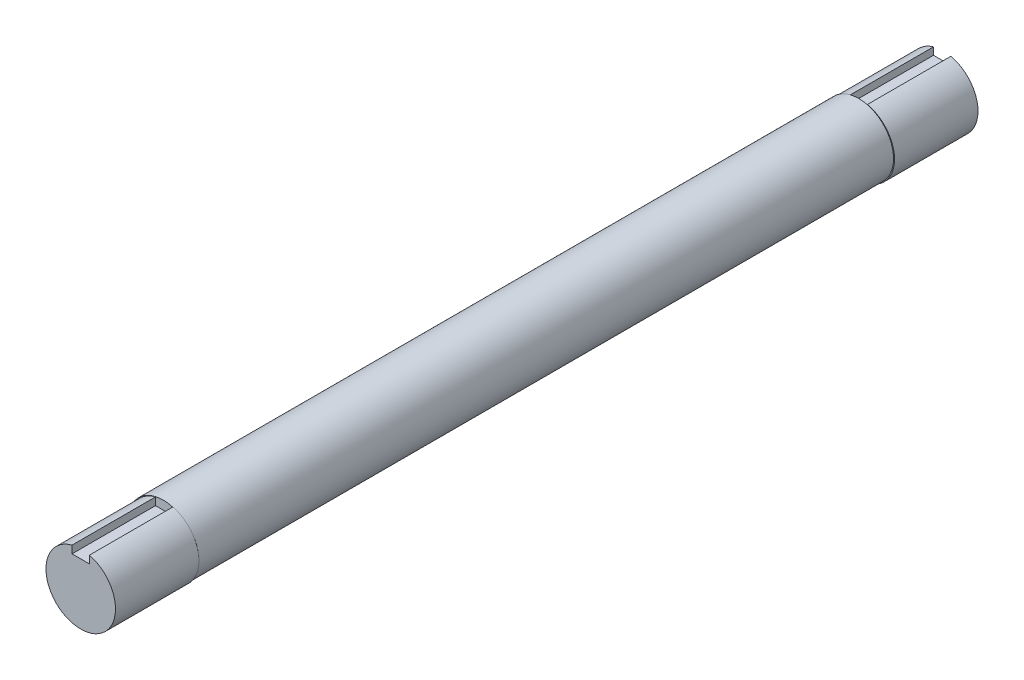
ISO-10303-21;
HEADER;
FILE_DESCRIPTION(('STEP AP214'),'2;1');
FILE_NAME('part.step','',(''),(''),'','','');
FILE_SCHEMA(('AUTOMOTIVE_DESIGN { 1 0 10303 214 1 1 1 1 }'));
ENDSEC;
DATA;
#1=APPLICATION_CONTEXT('core data for automotive mechanical design processes');
#2=APPLICATION_PROTOCOL_DEFINITION('international standard','automotive_design',2000,#1);
#3=PRODUCT_CONTEXT('',#1,'mechanical');
#4=PRODUCT('Part','Part','',(#3));
#5=PRODUCT_RELATED_PRODUCT_CATEGORY('part','',(#4));
#6=PRODUCT_DEFINITION_FORMATION('','',#4);
#7=PRODUCT_DEFINITION_CONTEXT('part definition',#1,'design');
#8=PRODUCT_DEFINITION('design','',#6,#7);
#9=PRODUCT_DEFINITION_SHAPE('','',#8);
#10=(LENGTH_UNIT() NAMED_UNIT(*) SI_UNIT(.MILLI.,.METRE.));
#11=(NAMED_UNIT(*) PLANE_ANGLE_UNIT() SI_UNIT($,.RADIAN.));
#12=(NAMED_UNIT(*) SI_UNIT($,.STERADIAN.) SOLID_ANGLE_UNIT());
#13=UNCERTAINTY_MEASURE_WITH_UNIT(LENGTH_MEASURE(1.E-05),#10,'distance_accuracy_value','');
#14=(GEOMETRIC_REPRESENTATION_CONTEXT(3) GLOBAL_UNCERTAINTY_ASSIGNED_CONTEXT((#13)) GLOBAL_UNIT_ASSIGNED_CONTEXT((#10,
#11,#12)) REPRESENTATION_CONTEXT('',''));
#15=CARTESIAN_POINT('',(0.,0.,0.));
#16=DIRECTION('',(0.,0.,1.));
#17=DIRECTION('',(1.,0.,0.));
#18=AXIS2_PLACEMENT_3D('',#15,#16,#17);
#19=CARTESIAN_POINT('',(-3.69874857792951,0.,0.));
#20=DIRECTION('',(0.,0.,1.));
#21=DIRECTION('',(1.,0.,0.));
#22=AXIS2_PLACEMENT_3D('',#19,#20,#21);
#23=PLANE('',#22);
#24=CARTESIAN_POINT('',(0.,0.,0.));
#25=DIRECTION('',(0.,0.,-1.));
#26=DIRECTION('',(-1.,0.,0.));
#27=AXIS2_PLACEMENT_3D('',#24,#25,#26);
#28=CIRCLE('',#27,127.053849768682);
#29=CARTESIAN_POINT('',(-3.69874857792983,-127.,0.));
#30=VERTEX_POINT('',#29);
#31=CARTESIAN_POINT('',(-35.4487485779296,122.008470875187,0.));
#32=VERTEX_POINT('',#31);
#33=EDGE_CURVE('E11',#30,#32,#28,.T.);
#34=ORIENTED_EDGE('',*,*,#33,.F.);
#35=CARTESIAN_POINT('',(-3.69874857792951,0.,0.));
#36=DIRECTION('',(0.,0.,1.));
#37=DIRECTION('',(1.,0.,0.));
#38=AXIS2_PLACEMENT_3D('',#35,#36,#37);
#39=CIRCLE('',#38,127.);
#40=CARTESIAN_POINT('',(28.0512514220705,122.967221242085,0.));
#41=VERTEX_POINT('',#40);
#42=EDGE_CURVE('E42',#41,#30,#39,.T.);
#43=ORIENTED_EDGE('',*,*,#42,.F.);
#44=DIRECTION('',(0.,1.,0.));
#45=VECTOR('',#44,1.);
#46=CARTESIAN_POINT('',(28.0512514220705,123.918554037313,0.));
#47=LINE('',#46,#45);
#48=CARTESIAN_POINT('',(28.0512514220705,95.25,0.));
#49=VERTEX_POINT('',#48);
#50=EDGE_CURVE('E194',#49,#41,#47,.T.);
#51=ORIENTED_EDGE('',*,*,#50,.F.);
#52=DIRECTION('',(1.,0.,0.));
#53=VECTOR('',#52,1.);
#54=CARTESIAN_POINT('',(28.0512514220705,95.25,0.));
#55=LINE('',#54,#53);
#56=CARTESIAN_POINT('',(-35.4487485779295,95.25,0.));
#57=VERTEX_POINT('',#56);
#58=EDGE_CURVE('E60',#57,#49,#55,.T.);
#59=ORIENTED_EDGE('',*,*,#58,.F.);
#60=DIRECTION('',(0.,-1.,0.));
#61=VECTOR('',#60,1.);
#62=CARTESIAN_POINT('',(-35.4487485779295,122.008470875187,0.));
#63=LINE('',#62,#61);
#64=EDGE_CURVE('E56',#32,#57,#63,.T.);
#65=ORIENTED_EDGE('',*,*,#64,.F.);
#66=EDGE_LOOP('',(#34,#43,#51,#59,#65));
#67=FACE_BOUND('',#66,.T.);
#68=ADVANCED_FACE('F38',(#67),#23,.F.);
#69=CARTESIAN_POINT('',(-3.69874857792951,0.,2540.));
#70=DIRECTION('',(0.,0.,-1.));
#71=DIRECTION('',(-1.,0.,0.));
#72=AXIS2_PLACEMENT_3D('',#69,#70,#71);
#73=CYLINDRICAL_SURFACE('',#72,127.);
#74=CARTESIAN_POINT('',(-3.69874857792951,0.,2540.));
#75=DIRECTION('',(0.,0.,1.));
#76=DIRECTION('',(1.,0.,0.));
#77=AXIS2_PLACEMENT_3D('',#74,#75,#76);
#78=CIRCLE('',#77,127.);
#79=CARTESIAN_POINT('',(31.75,121.95239326991,2540.));
#80=VERTEX_POINT('',#79);
#81=CARTESIAN_POINT('',(3.28730098697605E-13,-126.946127388579,2540.));
#82=VERTEX_POINT('',#81);
#83=EDGE_CURVE('E175',#80,#82,#78,.T.);
#84=ORIENTED_EDGE('',*,*,#83,.F.);
#85=EDGE_CURVE('E177',#82,#80,#78,.T.);
#86=ORIENTED_EDGE('',*,*,#85,.F.);
#87=EDGE_LOOP('',(#84,#86));
#88=FACE_BOUND('',#87,.T.);
#89=ORIENTED_EDGE('',*,*,#42,.T.);
#90=EDGE_CURVE('E174',#30,#41,#39,.T.);
#91=ORIENTED_EDGE('',*,*,#90,.T.);
#92=EDGE_LOOP('',(#89,#91));
#93=FACE_BOUND('',#92,.T.);
#94=ADVANCED_FACE('F40',(#88,#93),#73,.T.);
#95=CARTESIAN_POINT('',(-3.69874857792951,0.,2540.));
#96=DIRECTION('',(0.,0.,1.));
#97=DIRECTION('',(1.,0.,0.));
#98=AXIS2_PLACEMENT_3D('',#95,#96,#97);
#99=PLANE('',#98);
#100=DIRECTION('',(0.,-1.,0.));
#101=VECTOR('',#100,1.);
#102=CARTESIAN_POINT('',(31.75,122.911581061173,2540.));
#103=LINE('',#102,#101);
#104=CARTESIAN_POINT('',(31.75,95.1961273885787,2540.));
#105=VERTEX_POINT('',#104);
#106=EDGE_CURVE('E47',#80,#105,#103,.T.);
#107=ORIENTED_EDGE('',*,*,#106,.F.);
#108=ORIENTED_EDGE('',*,*,#83,.T.);
#109=CARTESIAN_POINT('',(0.,0.,2540.));
#110=DIRECTION('',(0.,0.,1.));
#111=DIRECTION('',(1.,0.,0.));
#112=AXIS2_PLACEMENT_3D('',#109,#110,#111);
#113=CIRCLE('',#112,126.946127388579);
#114=CARTESIAN_POINT('',(-31.75,122.911581061173,2540.));
#115=VERTEX_POINT('',#114);
#116=EDGE_CURVE('E149',#115,#82,#113,.T.);
#117=ORIENTED_EDGE('',*,*,#116,.F.);
#118=DIRECTION('',(0.,1.,0.));
#119=VECTOR('',#118,1.);
#120=CARTESIAN_POINT('',(-31.75,122.911581061173,2540.));
#121=LINE('',#120,#119);
#122=CARTESIAN_POINT('',(-31.75,95.1961273885787,2540.));
#123=VERTEX_POINT('',#122);
#124=EDGE_CURVE('E158',#123,#115,#121,.T.);
#125=ORIENTED_EDGE('',*,*,#124,.F.);
#126=DIRECTION('',(-1.,0.,0.));
#127=VECTOR('',#126,1.);
#128=CARTESIAN_POINT('',(-31.75,95.1961273885787,2540.));
#129=LINE('',#128,#127);
#130=EDGE_CURVE('E139',#105,#123,#129,.T.);
#131=ORIENTED_EDGE('',*,*,#130,.F.);
#132=EDGE_LOOP('',(#107,#108,#117,#125,#131));
#133=FACE_BOUND('',#132,.T.);
#134=ADVANCED_FACE('F223',(#133),#99,.T.);
#135=CARTESIAN_POINT('',(0.,0.,2540.));
#136=DIRECTION('',(0.,0.,1.));
#137=DIRECTION('',(1.,0.,0.));
#138=AXIS2_PLACEMENT_3D('',#135,#136,#137);
#139=PLANE('',#138);
#140=CARTESIAN_POINT('',(31.75,122.911581061173,2540.));
#141=VERTEX_POINT('',#140);
#142=EDGE_CURVE('E161',#82,#141,#113,.T.);
#143=ORIENTED_EDGE('',*,*,#142,.F.);
#144=ORIENTED_EDGE('',*,*,#85,.T.);
#145=EDGE_CURVE('E136',#141,#80,#103,.T.);
#146=ORIENTED_EDGE('',*,*,#145,.F.);
#147=EDGE_LOOP('',(#143,#144,#146));
#148=FACE_BOUND('',#147,.T.);
#149=ADVANCED_FACE('F228',(#148),#139,.F.);
#150=CARTESIAN_POINT('',(31.75,122.911581061173,2844.8));
#151=DIRECTION('',(1.,0.,0.));
#152=DIRECTION('',(0.,1.,0.));
#153=AXIS2_PLACEMENT_3D('',#150,#151,#152);
#154=PLANE('',#153);
#155=ORIENTED_EDGE('',*,*,#145,.T.);
#156=ORIENTED_EDGE('',*,*,#106,.T.);
#157=DIRECTION('',(0.,0.,-1.));
#158=VECTOR('',#157,1.);
#159=CARTESIAN_POINT('',(31.75,95.1961273885787,2844.8));
#160=LINE('',#159,#158);
#161=CARTESIAN_POINT('',(31.75,95.1961273885787,2844.8));
#162=VERTEX_POINT('',#161);
#163=EDGE_CURVE('E172',#162,#105,#160,.T.);
#164=ORIENTED_EDGE('',*,*,#163,.F.);
#165=DIRECTION('',(0.,-1.,0.));
#166=VECTOR('',#165,1.);
#167=CARTESIAN_POINT('',(31.75,122.911581061173,2844.8));
#168=LINE('',#167,#166);
#169=CARTESIAN_POINT('',(31.75,122.911581061173,2844.8));
#170=VERTEX_POINT('',#169);
#171=EDGE_CURVE('E145',#170,#162,#168,.T.);
#172=ORIENTED_EDGE('',*,*,#171,.F.);
#173=DIRECTION('',(0.,0.,-1.));
#174=VECTOR('',#173,1.);
#175=CARTESIAN_POINT('',(31.75,122.911581061173,2844.8));
#176=LINE('',#175,#174);
#177=EDGE_CURVE('E154',#170,#141,#176,.T.);
#178=ORIENTED_EDGE('',*,*,#177,.T.);
#179=EDGE_LOOP('',(#155,#156,#164,#172,#178));
#180=FACE_BOUND('',#179,.T.);
#181=ADVANCED_FACE('F229',(#180),#154,.F.);
#182=CARTESIAN_POINT('',(-31.75,95.1961273885787,2844.8));
#183=DIRECTION('',(0.,-1.,0.));
#184=DIRECTION('',(0.,0.,-1.));
#185=AXIS2_PLACEMENT_3D('',#182,#183,#184);
#186=PLANE('',#185);
#187=ORIENTED_EDGE('',*,*,#130,.T.);
#188=DIRECTION('',(0.,0.,-1.));
#189=VECTOR('',#188,1.);
#190=CARTESIAN_POINT('',(-31.75,95.1961273885787,2844.8));
#191=LINE('',#190,#189);
#192=CARTESIAN_POINT('',(-31.75,95.1961273885787,2844.8));
#193=VERTEX_POINT('',#192);
#194=EDGE_CURVE('E169',#193,#123,#191,.T.);
#195=ORIENTED_EDGE('',*,*,#194,.F.);
#196=DIRECTION('',(-1.,0.,0.));
#197=VECTOR('',#196,1.);
#198=CARTESIAN_POINT('',(-31.75,95.1961273885787,2844.8));
#199=LINE('',#198,#197);
#200=EDGE_CURVE('E148',#162,#193,#199,.T.);
#201=ORIENTED_EDGE('',*,*,#200,.F.);
#202=ORIENTED_EDGE('',*,*,#163,.T.);
#203=EDGE_LOOP('',(#187,#195,#201,#202));
#204=FACE_BOUND('',#203,.T.);
#205=ADVANCED_FACE('F232',(#204),#186,.F.);
#206=CARTESIAN_POINT('',(-31.75,122.911581061173,2844.8));
#207=DIRECTION('',(-1.,0.,0.));
#208=DIRECTION('',(0.,-1.,0.));
#209=AXIS2_PLACEMENT_3D('',#206,#207,#208);
#210=PLANE('',#209);
#211=ORIENTED_EDGE('',*,*,#124,.T.);
#212=DIRECTION('',(0.,0.,-1.));
#213=VECTOR('',#212,1.);
#214=CARTESIAN_POINT('',(-31.75,122.911581061173,2844.8));
#215=LINE('',#214,#213);
#216=CARTESIAN_POINT('',(-31.75,122.911581061173,2844.8));
#217=VERTEX_POINT('',#216);
#218=EDGE_CURVE('E166',#217,#115,#215,.T.);
#219=ORIENTED_EDGE('',*,*,#218,.F.);
#220=DIRECTION('',(0.,1.,0.));
#221=VECTOR('',#220,1.);
#222=CARTESIAN_POINT('',(-31.75,122.911581061173,2844.8));
#223=LINE('',#222,#221);
#224=EDGE_CURVE('E151',#193,#217,#223,.T.);
#225=ORIENTED_EDGE('',*,*,#224,.F.);
#226=ORIENTED_EDGE('',*,*,#194,.T.);
#227=EDGE_LOOP('',(#211,#219,#225,#226));
#228=FACE_BOUND('',#227,.T.);
#229=ADVANCED_FACE('F236',(#228),#210,.F.);
#230=CARTESIAN_POINT('',(0.,0.,2844.8));
#231=DIRECTION('',(0.,0.,-1.));
#232=DIRECTION('',(-1.,0.,0.));
#233=AXIS2_PLACEMENT_3D('',#230,#231,#232);
#234=CYLINDRICAL_SURFACE('',#233,126.946127388579);
#235=ORIENTED_EDGE('',*,*,#116,.T.);
#236=ORIENTED_EDGE('',*,*,#142,.T.);
#237=ORIENTED_EDGE('',*,*,#177,.F.);
#238=CARTESIAN_POINT('',(0.,0.,2844.8));
#239=DIRECTION('',(0.,0.,1.));
#240=DIRECTION('',(1.,0.,0.));
#241=AXIS2_PLACEMENT_3D('',#238,#239,#240);
#242=CIRCLE('',#241,126.946127388579);
#243=EDGE_CURVE('E153',#217,#170,#242,.T.);
#244=ORIENTED_EDGE('',*,*,#243,.F.);
#245=ORIENTED_EDGE('',*,*,#218,.T.);
#246=EDGE_LOOP('',(#235,#236,#237,#244,#245));
#247=FACE_BOUND('',#246,.T.);
#248=ADVANCED_FACE('F240',(#247),#234,.T.);
#249=CARTESIAN_POINT('',(0.,0.,2844.8));
#250=DIRECTION('',(0.,0.,1.));
#251=DIRECTION('',(1.,0.,0.));
#252=AXIS2_PLACEMENT_3D('',#249,#250,#251);
#253=PLANE('',#252);
#254=ORIENTED_EDGE('',*,*,#171,.T.);
#255=ORIENTED_EDGE('',*,*,#200,.T.);
#256=ORIENTED_EDGE('',*,*,#224,.T.);
#257=ORIENTED_EDGE('',*,*,#243,.T.);
#258=EDGE_LOOP('',(#254,#255,#256,#257));
#259=FACE_BOUND('',#258,.T.);
#260=ADVANCED_FACE('F244',(#259),#253,.T.);
#261=CARTESIAN_POINT('',(-35.4487485779295,122.008470875187,-304.8));
#262=DIRECTION('',(-1.,0.,0.));
#263=DIRECTION('',(0.,0.,1.));
#264=AXIS2_PLACEMENT_3D('',#261,#262,#263);
#265=PLANE('',#264);
#266=ORIENTED_EDGE('',*,*,#64,.T.);
#267=DIRECTION('',(0.,0.,1.));
#268=VECTOR('',#267,1.);
#269=CARTESIAN_POINT('',(-35.4487485779295,95.25,-304.8));
#270=LINE('',#269,#268);
#271=CARTESIAN_POINT('',(-35.4487485779295,95.25,-304.8));
#272=VERTEX_POINT('',#271);
#273=EDGE_CURVE('E119',#272,#57,#270,.T.);
#274=ORIENTED_EDGE('',*,*,#273,.F.);
#275=DIRECTION('',(0.,-1.,0.));
#276=VECTOR('',#275,1.);
#277=CARTESIAN_POINT('',(-35.4487485779295,122.008470875187,-304.8));
#278=LINE('',#277,#276);
#279=CARTESIAN_POINT('',(-35.4487485779296,122.008470875187,-304.8));
#280=VERTEX_POINT('',#279);
#281=EDGE_CURVE('E125',#280,#272,#278,.T.);
#282=ORIENTED_EDGE('',*,*,#281,.F.);
#283=DIRECTION('',(0.,0.,1.));
#284=VECTOR('',#283,1.);
#285=CARTESIAN_POINT('',(-35.4487485779296,122.008470875187,-304.8));
#286=LINE('',#285,#284);
#287=EDGE_CURVE('E205',#280,#32,#286,.T.);
#288=ORIENTED_EDGE('',*,*,#287,.T.);
#289=EDGE_LOOP('',(#266,#274,#282,#288));
#290=FACE_BOUND('',#289,.T.);
#291=ADVANCED_FACE('F135',(#290),#265,.F.);
#292=CARTESIAN_POINT('',(28.0512514220705,95.25,-304.8));
#293=DIRECTION('',(0.,-1.,0.));
#294=DIRECTION('',(0.,0.,-1.));
#295=AXIS2_PLACEMENT_3D('',#292,#293,#294);
#296=PLANE('',#295);
#297=ORIENTED_EDGE('',*,*,#58,.T.);
#298=DIRECTION('',(0.,0.,1.));
#299=VECTOR('',#298,1.);
#300=CARTESIAN_POINT('',(28.0512514220705,95.25,-304.8));
#301=LINE('',#300,#299);
#302=CARTESIAN_POINT('',(28.0512514220705,95.25,-304.8));
#303=VERTEX_POINT('',#302);
#304=EDGE_CURVE('E121',#303,#49,#301,.T.);
#305=ORIENTED_EDGE('',*,*,#304,.F.);
#306=DIRECTION('',(1.,0.,0.));
#307=VECTOR('',#306,1.);
#308=CARTESIAN_POINT('',(28.0512514220705,95.25,-304.8));
#309=LINE('',#308,#307);
#310=EDGE_CURVE('E115',#272,#303,#309,.T.);
#311=ORIENTED_EDGE('',*,*,#310,.F.);
#312=ORIENTED_EDGE('',*,*,#273,.T.);
#313=EDGE_LOOP('',(#297,#305,#311,#312));
#314=FACE_BOUND('',#313,.T.);
#315=ADVANCED_FACE('F117',(#314),#296,.F.);
#316=CARTESIAN_POINT('',(28.0512514220705,123.918554037313,-304.8));
#317=DIRECTION('',(1.,0.,0.));
#318=DIRECTION('',(0.,0.,-1.));
#319=AXIS2_PLACEMENT_3D('',#316,#317,#318);
#320=PLANE('',#319);
#321=ORIENTED_EDGE('',*,*,#50,.T.);
#322=CARTESIAN_POINT('',(28.0512514220705,123.918554037313,0.));
#323=VERTEX_POINT('',#322);
#324=EDGE_CURVE('E195',#41,#323,#47,.T.);
#325=ORIENTED_EDGE('',*,*,#324,.T.);
#326=DIRECTION('',(0.,0.,1.));
#327=VECTOR('',#326,1.);
#328=CARTESIAN_POINT('',(28.0512514220705,123.918554037313,-304.8));
#329=LINE('',#328,#327);
#330=CARTESIAN_POINT('',(28.0512514220705,123.918554037313,-304.8));
#331=VERTEX_POINT('',#330);
#332=EDGE_CURVE('E141',#331,#323,#329,.T.);
#333=ORIENTED_EDGE('',*,*,#332,.F.);
#334=DIRECTION('',(0.,1.,0.));
#335=VECTOR('',#334,1.);
#336=CARTESIAN_POINT('',(28.0512514220705,123.918554037313,-304.8));
#337=LINE('',#336,#335);
#338=EDGE_CURVE('E124',#303,#331,#337,.T.);
#339=ORIENTED_EDGE('',*,*,#338,.F.);
#340=ORIENTED_EDGE('',*,*,#304,.T.);
#341=EDGE_LOOP('',(#321,#325,#333,#339,#340));
#342=FACE_BOUND('',#341,.T.);
#343=ADVANCED_FACE('F201',(#342),#320,.F.);
#344=CARTESIAN_POINT('',(0.,0.,-304.8));
#345=DIRECTION('',(0.,0.,1.));
#346=DIRECTION('',(1.,0.,0.));
#347=AXIS2_PLACEMENT_3D('',#344,#345,#346);
#348=CYLINDRICAL_SURFACE('',#347,127.053849768682);
#349=EDGE_CURVE('E49',#323,#30,#28,.T.);
#350=ORIENTED_EDGE('',*,*,#349,.T.);
#351=ORIENTED_EDGE('',*,*,#33,.T.);
#352=ORIENTED_EDGE('',*,*,#287,.F.);
#353=CARTESIAN_POINT('',(0.,0.,-304.8));
#354=DIRECTION('',(0.,0.,-1.));
#355=DIRECTION('',(-1.,0.,0.));
#356=AXIS2_PLACEMENT_3D('',#353,#354,#355);
#357=CIRCLE('',#356,127.053849768682);
#358=EDGE_CURVE('E130',#331,#280,#357,.T.);
#359=ORIENTED_EDGE('',*,*,#358,.F.);
#360=ORIENTED_EDGE('',*,*,#332,.T.);
#361=EDGE_LOOP('',(#350,#351,#352,#359,#360));
#362=FACE_BOUND('',#361,.T.);
#363=ADVANCED_FACE('F207',(#362),#348,.T.);
#364=CARTESIAN_POINT('',(0.,0.,-304.8));
#365=DIRECTION('',(0.,0.,-1.));
#366=DIRECTION('',(-1.,0.,0.));
#367=AXIS2_PLACEMENT_3D('',#364,#365,#366);
#368=PLANE('',#367);
#369=ORIENTED_EDGE('',*,*,#281,.T.);
#370=ORIENTED_EDGE('',*,*,#310,.T.);
#371=ORIENTED_EDGE('',*,*,#338,.T.);
#372=ORIENTED_EDGE('',*,*,#358,.T.);
#373=EDGE_LOOP('',(#369,#370,#371,#372));
#374=FACE_BOUND('',#373,.T.);
#375=ADVANCED_FACE('F128',(#374),#368,.T.);
#376=CARTESIAN_POINT('',(0.,0.,0.));
#377=DIRECTION('',(0.,0.,-1.));
#378=DIRECTION('',(-1.,0.,0.));
#379=AXIS2_PLACEMENT_3D('',#376,#377,#378);
#380=PLANE('',#379);
#381=ORIENTED_EDGE('',*,*,#90,.F.);
#382=ORIENTED_EDGE('',*,*,#349,.F.);
#383=ORIENTED_EDGE('',*,*,#324,.F.);
#384=EDGE_LOOP('',(#381,#382,#383));
#385=FACE_BOUND('',#384,.T.);
#386=ADVANCED_FACE('F196',(#385),#380,.F.);
#387=CLOSED_SHELL('',(#68,#94,#134,#149,#181,#205,#229,#248,#260,#291,#315,#343,#363,#375,#386));
#388=MANIFOLD_SOLID_BREP('B2',#387);
#389=ADVANCED_BREP_SHAPE_REPRESENTATION('',(#18,#388),#14);
#390=SHAPE_DEFINITION_REPRESENTATION(#9,#389);
ENDSEC;
END-ISO-10303-21;
